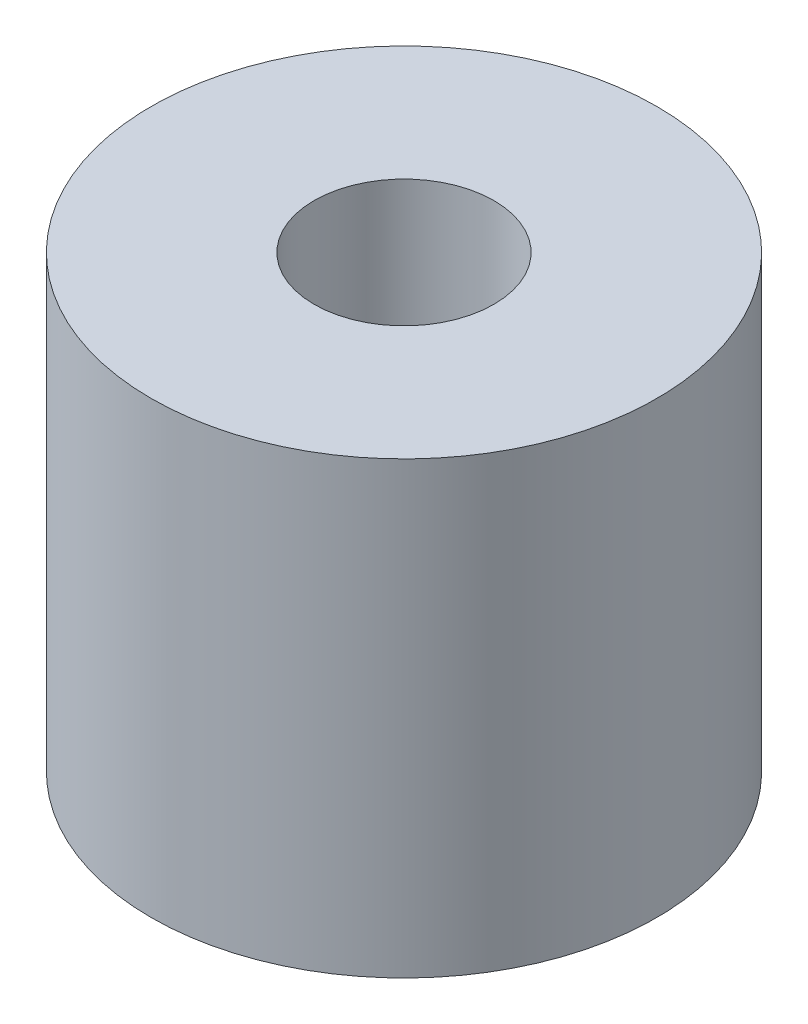
ISO-10303-21;
HEADER;
FILE_DESCRIPTION(('STEP AP214'),'2;1');
FILE_NAME('part.step','',(''),(''),'','','');
FILE_SCHEMA(('AUTOMOTIVE_DESIGN { 1 0 10303 214 1 1 1 1 }'));
ENDSEC;
DATA;
#1=APPLICATION_CONTEXT('core data for automotive mechanical design processes');
#2=APPLICATION_PROTOCOL_DEFINITION('international standard','automotive_design',2000,#1);
#3=PRODUCT_CONTEXT('',#1,'mechanical');
#4=PRODUCT('Part','Part','',(#3));
#5=PRODUCT_RELATED_PRODUCT_CATEGORY('part','',(#4));
#6=PRODUCT_DEFINITION_FORMATION('','',#4);
#7=PRODUCT_DEFINITION_CONTEXT('part definition',#1,'design');
#8=PRODUCT_DEFINITION('design','',#6,#7);
#9=PRODUCT_DEFINITION_SHAPE('','',#8);
#10=(LENGTH_UNIT() NAMED_UNIT(*) SI_UNIT(.MILLI.,.METRE.));
#11=(NAMED_UNIT(*) PLANE_ANGLE_UNIT() SI_UNIT($,.RADIAN.));
#12=(NAMED_UNIT(*) SI_UNIT($,.STERADIAN.) SOLID_ANGLE_UNIT());
#13=UNCERTAINTY_MEASURE_WITH_UNIT(LENGTH_MEASURE(1.E-05),#10,'distance_accuracy_value','');
#14=(GEOMETRIC_REPRESENTATION_CONTEXT(3) GLOBAL_UNCERTAINTY_ASSIGNED_CONTEXT((#13)) GLOBAL_UNIT_ASSIGNED_CONTEXT((#10,
#11,#12)) REPRESENTATION_CONTEXT('',''));
#15=CARTESIAN_POINT('',(0.,0.,0.));
#16=DIRECTION('',(0.,0.,1.));
#17=DIRECTION('',(1.,0.,0.));
#18=AXIS2_PLACEMENT_3D('',#15,#16,#17);
#19=CARTESIAN_POINT('',(0.,8.,0.));
#20=DIRECTION('',(0.,1.,0.));
#21=DIRECTION('',(0.,0.,1.));
#22=AXIS2_PLACEMENT_3D('',#19,#20,#21);
#23=PLANE('',#22);
#24=CARTESIAN_POINT('',(0.,8.,0.));
#25=DIRECTION('',(0.,1.,0.));
#26=DIRECTION('',(0.,0.,1.));
#27=AXIS2_PLACEMENT_3D('',#24,#25,#26);
#28=CIRCLE('',#27,4.5);
#29=CARTESIAN_POINT('',(0.,8.,4.5));
#30=VERTEX_POINT('',#29);
#31=EDGE_CURVE('E10',#30,#30,#28,.T.);
#32=ORIENTED_EDGE('',*,*,#31,.T.);
#33=EDGE_LOOP('',(#32));
#34=FACE_BOUND('',#33,.T.);
#35=CARTESIAN_POINT('',(0.,8.,0.));
#36=DIRECTION('',(0.,1.,0.));
#37=DIRECTION('',(0.,0.,1.));
#38=AXIS2_PLACEMENT_3D('',#35,#36,#37);
#39=CIRCLE('',#38,1.6);
#40=CARTESIAN_POINT('',(0.,8.,1.6));
#41=VERTEX_POINT('',#40);
#42=EDGE_CURVE('E42',#41,#41,#39,.T.);
#43=ORIENTED_EDGE('',*,*,#42,.F.);
#44=EDGE_LOOP('',(#43));
#45=FACE_BOUND('',#44,.T.);
#46=ADVANCED_FACE('F31',(#34,#45),#23,.T.);
#47=CARTESIAN_POINT('',(0.,0.,0.));
#48=DIRECTION('',(0.,1.,0.));
#49=DIRECTION('',(0.,0.,1.));
#50=AXIS2_PLACEMENT_3D('',#47,#48,#49);
#51=PLANE('',#50);
#52=CARTESIAN_POINT('',(0.,0.,0.));
#53=DIRECTION('',(0.,1.,0.));
#54=DIRECTION('',(0.,0.,1.));
#55=AXIS2_PLACEMENT_3D('',#52,#53,#54);
#56=CIRCLE('',#55,4.5);
#57=CARTESIAN_POINT('',(0.,0.,4.5));
#58=VERTEX_POINT('',#57);
#59=EDGE_CURVE('E35',#58,#58,#56,.T.);
#60=ORIENTED_EDGE('',*,*,#59,.F.);
#61=EDGE_LOOP('',(#60));
#62=FACE_BOUND('',#61,.T.);
#63=CARTESIAN_POINT('',(0.,0.,0.));
#64=DIRECTION('',(0.,1.,0.));
#65=DIRECTION('',(0.,0.,1.));
#66=AXIS2_PLACEMENT_3D('',#63,#64,#65);
#67=CIRCLE('',#66,1.6);
#68=CARTESIAN_POINT('',(0.,0.,1.6));
#69=VERTEX_POINT('',#68);
#70=EDGE_CURVE('E44',#69,#69,#67,.T.);
#71=ORIENTED_EDGE('',*,*,#70,.T.);
#72=EDGE_LOOP('',(#71));
#73=FACE_BOUND('',#72,.T.);
#74=ADVANCED_FACE('F54',(#62,#73),#51,.F.);
#75=CARTESIAN_POINT('',(0.,8.,0.));
#76=DIRECTION('',(0.,-1.,0.));
#77=DIRECTION('',(0.,0.,-1.));
#78=AXIS2_PLACEMENT_3D('',#75,#76,#77);
#79=CYLINDRICAL_SURFACE('',#78,4.5);
#80=ORIENTED_EDGE('',*,*,#31,.F.);
#81=EDGE_LOOP('',(#80));
#82=FACE_BOUND('',#81,.T.);
#83=ORIENTED_EDGE('',*,*,#59,.T.);
#84=EDGE_LOOP('',(#83));
#85=FACE_BOUND('',#84,.T.);
#86=ADVANCED_FACE('F33',(#82,#85),#79,.T.);
#87=CARTESIAN_POINT('',(0.,8.,0.));
#88=DIRECTION('',(0.,-1.,0.));
#89=DIRECTION('',(0.,0.,-1.));
#90=AXIS2_PLACEMENT_3D('',#87,#88,#89);
#91=CYLINDRICAL_SURFACE('',#90,1.6);
#92=ORIENTED_EDGE('',*,*,#42,.T.);
#93=EDGE_LOOP('',(#92));
#94=FACE_BOUND('',#93,.T.);
#95=ORIENTED_EDGE('',*,*,#70,.F.);
#96=EDGE_LOOP('',(#95));
#97=FACE_BOUND('',#96,.T.);
#98=ADVANCED_FACE('F50',(#94,#97),#91,.F.);
#99=CLOSED_SHELL('',(#46,#74,#86,#98));
#100=MANIFOLD_SOLID_BREP('B2',#99);
#101=ADVANCED_BREP_SHAPE_REPRESENTATION('',(#18,#100),#14);
#102=SHAPE_DEFINITION_REPRESENTATION(#9,#101);
ENDSEC;
END-ISO-10303-21;
